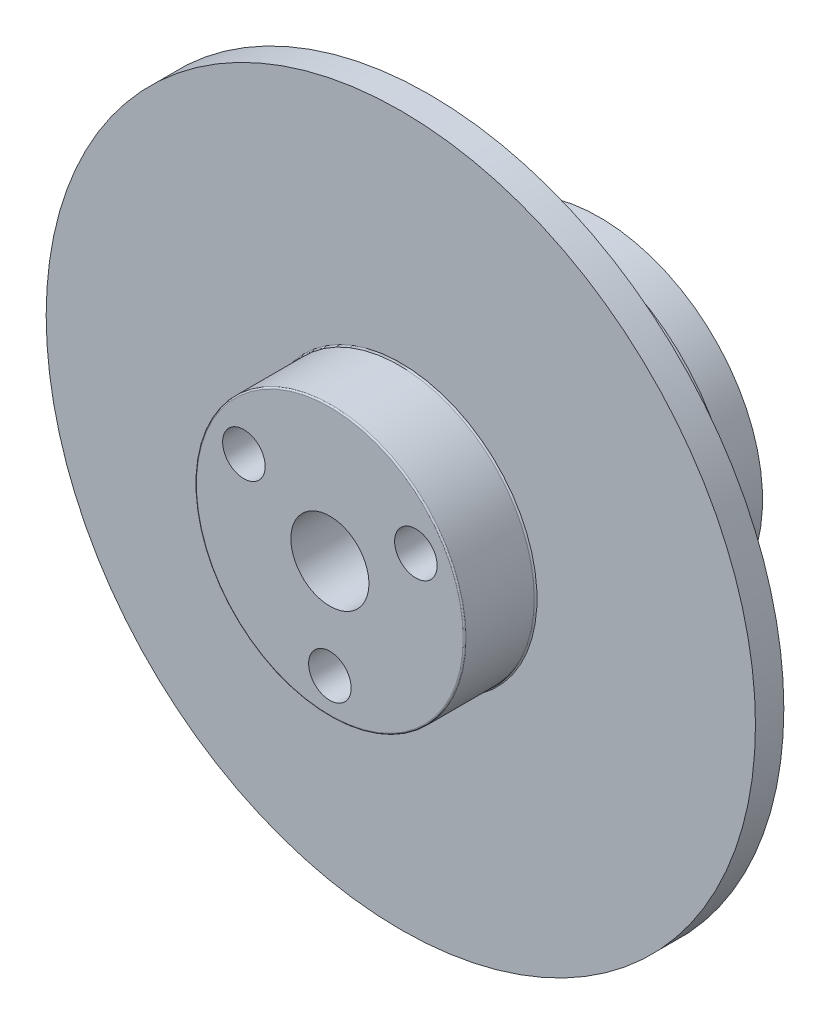
ISO-10303-21;
HEADER;
FILE_DESCRIPTION(('STEP AP214'),'2;1');
FILE_NAME('part.step','',(''),(''),'','','');
FILE_SCHEMA(('AUTOMOTIVE_DESIGN { 1 0 10303 214 1 1 1 1 }'));
ENDSEC;
DATA;
#1=APPLICATION_CONTEXT('core data for automotive mechanical design processes');
#2=APPLICATION_PROTOCOL_DEFINITION('international standard','automotive_design',2000,#1);
#3=PRODUCT_CONTEXT('',#1,'mechanical');
#4=PRODUCT('Part','Part','',(#3));
#5=PRODUCT_RELATED_PRODUCT_CATEGORY('part','',(#4));
#6=PRODUCT_DEFINITION_FORMATION('','',#4);
#7=PRODUCT_DEFINITION_CONTEXT('part definition',#1,'design');
#8=PRODUCT_DEFINITION('design','',#6,#7);
#9=PRODUCT_DEFINITION_SHAPE('','',#8);
#10=(LENGTH_UNIT() NAMED_UNIT(*) SI_UNIT(.MILLI.,.METRE.));
#11=(NAMED_UNIT(*) PLANE_ANGLE_UNIT() SI_UNIT($,.RADIAN.));
#12=(NAMED_UNIT(*) SI_UNIT($,.STERADIAN.) SOLID_ANGLE_UNIT());
#13=UNCERTAINTY_MEASURE_WITH_UNIT(LENGTH_MEASURE(1.E-05),#10,'distance_accuracy_value','');
#14=(GEOMETRIC_REPRESENTATION_CONTEXT(3) GLOBAL_UNCERTAINTY_ASSIGNED_CONTEXT((#13)) GLOBAL_UNIT_ASSIGNED_CONTEXT((#10,
#11,#12)) REPRESENTATION_CONTEXT('',''));
#15=CARTESIAN_POINT('',(0.,0.,0.));
#16=DIRECTION('',(0.,0.,1.));
#17=DIRECTION('',(1.,0.,0.));
#18=AXIS2_PLACEMENT_3D('',#15,#16,#17);
#19=CARTESIAN_POINT('',(0.,0.,5.));
#20=DIRECTION('',(0.,0.,1.));
#21=DIRECTION('',(1.,0.,0.));
#22=AXIS2_PLACEMENT_3D('',#19,#20,#21);
#23=PLANE('',#22);
#24=CARTESIAN_POINT('',(0.,0.,5.));
#25=DIRECTION('',(0.,0.,-1.));
#26=DIRECTION('',(-1.,0.,0.));
#27=AXIS2_PLACEMENT_3D('',#24,#25,#26);
#28=CIRCLE('',#27,2.75);
#29=CARTESIAN_POINT('',(-2.75,0.,5.));
#30=VERTEX_POINT('',#29);
#31=EDGE_CURVE('E114',#30,#30,#28,.T.);
#32=ORIENTED_EDGE('',*,*,#31,.T.);
#33=EDGE_LOOP('',(#32));
#34=FACE_BOUND('',#33,.T.);
#35=CARTESIAN_POINT('',(-6.0621778264911,3.49999999999994,5.));
#36=DIRECTION('',(0.,0.,1.));
#37=DIRECTION('',(1.,0.,0.));
#38=AXIS2_PLACEMENT_3D('',#35,#36,#37);
#39=CIRCLE('',#38,1.49999999999999);
#40=CARTESIAN_POINT('',(-4.56217782649111,3.49999999999994,5.));
#41=VERTEX_POINT('',#40);
#42=EDGE_CURVE('E117',#41,#41,#39,.T.);
#43=ORIENTED_EDGE('',*,*,#42,.F.);
#44=EDGE_LOOP('',(#43));
#45=FACE_BOUND('',#44,.T.);
#46=CARTESIAN_POINT('',(6.06217782649105,3.50000000000003,5.));
#47=DIRECTION('',(0.,0.,1.));
#48=DIRECTION('',(1.,0.,0.));
#49=AXIS2_PLACEMENT_3D('',#46,#47,#48);
#50=CIRCLE('',#49,1.49999999999999);
#51=CARTESIAN_POINT('',(7.56217782649104,3.50000000000003,5.));
#52=VERTEX_POINT('',#51);
#53=EDGE_CURVE('E123',#52,#52,#50,.T.);
#54=ORIENTED_EDGE('',*,*,#53,.F.);
#55=EDGE_LOOP('',(#54));
#56=FACE_BOUND('',#55,.T.);
#57=CARTESIAN_POINT('',(0.,-7.,5.));
#58=DIRECTION('',(0.,0.,1.));
#59=DIRECTION('',(1.,0.,0.));
#60=AXIS2_PLACEMENT_3D('',#57,#58,#59);
#61=CIRCLE('',#60,1.49999999999999);
#62=CARTESIAN_POINT('',(1.49999999999999,-7.,5.));
#63=VERTEX_POINT('',#62);
#64=EDGE_CURVE('E129',#63,#63,#61,.T.);
#65=ORIENTED_EDGE('',*,*,#64,.F.);
#66=EDGE_LOOP('',(#65));
#67=FACE_BOUND('',#66,.T.);
#68=CARTESIAN_POINT('',(0.,0.,5.));
#69=DIRECTION('',(0.,0.,1.));
#70=DIRECTION('',(1.,0.,0.));
#71=AXIS2_PLACEMENT_3D('',#68,#69,#70);
#72=CIRCLE('',#71,9.4);
#73=CARTESIAN_POINT('',(9.4,0.,5.));
#74=VERTEX_POINT('',#73);
#75=EDGE_CURVE('E11',#74,#74,#72,.T.);
#76=ORIENTED_EDGE('',*,*,#75,.T.);
#77=EDGE_LOOP('',(#76));
#78=FACE_BOUND('',#77,.T.);
#79=ADVANCED_FACE('F42',(#34,#45,#56,#67,#78),#23,.T.);
#80=CARTESIAN_POINT('',(0.,0.,-2.));
#81=DIRECTION('',(0.,0.,-1.));
#82=DIRECTION('',(-1.,0.,0.));
#83=AXIS2_PLACEMENT_3D('',#80,#81,#82);
#84=PLANE('',#83);
#85=CARTESIAN_POINT('',(0.,0.,-2.));
#86=DIRECTION('',(0.,0.,-1.));
#87=DIRECTION('',(-1.,0.,0.));
#88=AXIS2_PLACEMENT_3D('',#85,#86,#87);
#89=CIRCLE('',#88,13.5);
#90=CARTESIAN_POINT('',(-13.5,0.,-2.));
#91=VERTEX_POINT('',#90);
#92=EDGE_CURVE('E164',#91,#91,#89,.T.);
#93=ORIENTED_EDGE('',*,*,#92,.F.);
#94=EDGE_LOOP('',(#93));
#95=FACE_BOUND('',#94,.T.);
#96=CARTESIAN_POINT('',(0.,0.,-2.));
#97=DIRECTION('',(0.,0.,-1.));
#98=DIRECTION('',(-1.,0.,0.));
#99=AXIS2_PLACEMENT_3D('',#96,#97,#98);
#100=CIRCLE('',#99,25.);
#101=CARTESIAN_POINT('',(-25.,0.,-2.));
#102=VERTEX_POINT('',#101);
#103=EDGE_CURVE('E167',#102,#102,#100,.T.);
#104=ORIENTED_EDGE('',*,*,#103,.T.);
#105=EDGE_LOOP('',(#104));
#106=FACE_BOUND('',#105,.T.);
#107=ADVANCED_FACE('F206',(#95,#106),#84,.T.);
#108=CARTESIAN_POINT('',(0.,0.,0.));
#109=DIRECTION('',(0.,0.,-1.));
#110=DIRECTION('',(-1.,0.,0.));
#111=AXIS2_PLACEMENT_3D('',#108,#109,#110);
#112=PLANE('',#111);
#113=CARTESIAN_POINT('',(0.,0.,0.));
#114=DIRECTION('',(0.,0.,-1.));
#115=DIRECTION('',(-1.,0.,0.));
#116=AXIS2_PLACEMENT_3D('',#113,#114,#115);
#117=CIRCLE('',#116,9.6);
#118=CARTESIAN_POINT('',(-9.6,0.,0.));
#119=VERTEX_POINT('',#118);
#120=EDGE_CURVE('E50',#119,#119,#117,.T.);
#121=ORIENTED_EDGE('',*,*,#120,.T.);
#122=EDGE_LOOP('',(#121));
#123=FACE_BOUND('',#122,.T.);
#124=CARTESIAN_POINT('',(0.,0.,0.));
#125=DIRECTION('',(0.,0.,-1.));
#126=DIRECTION('',(-1.,0.,0.));
#127=AXIS2_PLACEMENT_3D('',#124,#125,#126);
#128=CIRCLE('',#127,25.);
#129=CARTESIAN_POINT('',(-25.,0.,0.));
#130=VERTEX_POINT('',#129);
#131=EDGE_CURVE('E171',#130,#130,#128,.T.);
#132=ORIENTED_EDGE('',*,*,#131,.F.);
#133=EDGE_LOOP('',(#132));
#134=FACE_BOUND('',#133,.T.);
#135=ADVANCED_FACE('F185',(#123,#134),#112,.F.);
#136=CARTESIAN_POINT('',(0.,0.,-2.));
#137=DIRECTION('',(0.,0.,1.));
#138=DIRECTION('',(1.,0.,0.));
#139=AXIS2_PLACEMENT_3D('',#136,#137,#138);
#140=CYLINDRICAL_SURFACE('',#139,25.);
#141=ORIENTED_EDGE('',*,*,#103,.F.);
#142=EDGE_LOOP('',(#141));
#143=FACE_BOUND('',#142,.T.);
#144=ORIENTED_EDGE('',*,*,#131,.T.);
#145=EDGE_LOOP('',(#144));
#146=FACE_BOUND('',#145,.T.);
#147=ADVANCED_FACE('F260',(#143,#146),#140,.T.);
#148=CARTESIAN_POINT('',(0.,0.,-4.));
#149=DIRECTION('',(0.,0.,1.));
#150=DIRECTION('',(1.,0.,0.));
#151=AXIS2_PLACEMENT_3D('',#148,#149,#150);
#152=CYLINDRICAL_SURFACE('',#151,13.5);
#153=CARTESIAN_POINT('',(0.,0.,-4.));
#154=DIRECTION('',(0.,0.,-1.));
#155=DIRECTION('',(-1.,0.,0.));
#156=AXIS2_PLACEMENT_3D('',#153,#154,#155);
#157=CIRCLE('',#156,13.5);
#158=CARTESIAN_POINT('',(-13.5,0.,-4.));
#159=VERTEX_POINT('',#158);
#160=EDGE_CURVE('E168',#159,#159,#157,.T.);
#161=ORIENTED_EDGE('',*,*,#160,.F.);
#162=EDGE_LOOP('',(#161));
#163=FACE_BOUND('',#162,.T.);
#164=ORIENTED_EDGE('',*,*,#92,.T.);
#165=EDGE_LOOP('',(#164));
#166=FACE_BOUND('',#165,.T.);
#167=ADVANCED_FACE('F257',(#163,#166),#152,.T.);
#168=CARTESIAN_POINT('',(0.,0.,-4.));
#169=DIRECTION('',(0.,0.,-1.));
#170=DIRECTION('',(-1.,0.,0.));
#171=AXIS2_PLACEMENT_3D('',#168,#169,#170);
#172=PLANE('',#171);
#173=CARTESIAN_POINT('',(0.,0.,-4.));
#174=DIRECTION('',(0.,0.,-1.));
#175=DIRECTION('',(-1.,0.,0.));
#176=AXIS2_PLACEMENT_3D('',#173,#174,#175);
#177=CIRCLE('',#176,12.5);
#178=CARTESIAN_POINT('',(-12.5,0.,-4.));
#179=VERTEX_POINT('',#178);
#180=EDGE_CURVE('E152',#179,#179,#177,.T.);
#181=ORIENTED_EDGE('',*,*,#180,.F.);
#182=EDGE_LOOP('',(#181));
#183=FACE_BOUND('',#182,.T.);
#184=ORIENTED_EDGE('',*,*,#160,.T.);
#185=EDGE_LOOP('',(#184));
#186=FACE_BOUND('',#185,.T.);
#187=ADVANCED_FACE('F253',(#183,#186),#172,.T.);
#188=CARTESIAN_POINT('',(0.,0.,-11.));
#189=DIRECTION('',(0.,0.,1.));
#190=DIRECTION('',(1.,0.,0.));
#191=AXIS2_PLACEMENT_3D('',#188,#189,#190);
#192=CYLINDRICAL_SURFACE('',#191,12.5);
#193=CARTESIAN_POINT('',(0.,0.,-11.));
#194=DIRECTION('',(0.,0.,-1.));
#195=DIRECTION('',(-1.,0.,0.));
#196=AXIS2_PLACEMENT_3D('',#193,#194,#195);
#197=CIRCLE('',#196,12.5);
#198=CARTESIAN_POINT('',(-12.5,0.,-11.));
#199=VERTEX_POINT('',#198);
#200=EDGE_CURVE('E161',#199,#199,#197,.T.);
#201=ORIENTED_EDGE('',*,*,#200,.F.);
#202=EDGE_LOOP('',(#201));
#203=FACE_BOUND('',#202,.T.);
#204=ORIENTED_EDGE('',*,*,#180,.T.);
#205=EDGE_LOOP('',(#204));
#206=FACE_BOUND('',#205,.T.);
#207=ADVANCED_FACE('F249',(#203,#206),#192,.T.);
#208=CARTESIAN_POINT('',(0.,0.,-11.));
#209=DIRECTION('',(0.,0.,-1.));
#210=DIRECTION('',(-1.,0.,0.));
#211=AXIS2_PLACEMENT_3D('',#208,#209,#210);
#212=PLANE('',#211);
#213=CARTESIAN_POINT('',(0.,0.,-11.));
#214=DIRECTION('',(0.,0.,-1.));
#215=DIRECTION('',(-1.,0.,0.));
#216=AXIS2_PLACEMENT_3D('',#213,#214,#215);
#217=CIRCLE('',#216,11.5);
#218=CARTESIAN_POINT('',(-11.5,0.,-11.));
#219=VERTEX_POINT('',#218);
#220=EDGE_CURVE('E148',#219,#219,#217,.T.);
#221=ORIENTED_EDGE('',*,*,#220,.F.);
#222=EDGE_LOOP('',(#221));
#223=FACE_BOUND('',#222,.T.);
#224=ORIENTED_EDGE('',*,*,#200,.T.);
#225=EDGE_LOOP('',(#224));
#226=FACE_BOUND('',#225,.T.);
#227=ADVANCED_FACE('F225',(#223,#226),#212,.T.);
#228=CARTESIAN_POINT('',(0.,0.,-14.));
#229=DIRECTION('',(0.,0.,1.));
#230=DIRECTION('',(1.,0.,0.));
#231=AXIS2_PLACEMENT_3D('',#228,#229,#230);
#232=CYLINDRICAL_SURFACE('',#231,11.5);
#233=CARTESIAN_POINT('',(0.,0.,-14.));
#234=DIRECTION('',(0.,0.,-1.));
#235=DIRECTION('',(-1.,0.,0.));
#236=AXIS2_PLACEMENT_3D('',#233,#234,#235);
#237=CIRCLE('',#236,11.5);
#238=CARTESIAN_POINT('',(-11.5,0.,-14.));
#239=VERTEX_POINT('',#238);
#240=EDGE_CURVE('E144',#239,#239,#237,.T.);
#241=ORIENTED_EDGE('',*,*,#240,.F.);
#242=EDGE_LOOP('',(#241));
#243=FACE_BOUND('',#242,.T.);
#244=ORIENTED_EDGE('',*,*,#220,.T.);
#245=EDGE_LOOP('',(#244));
#246=FACE_BOUND('',#245,.T.);
#247=ADVANCED_FACE('F221',(#243,#246),#232,.T.);
#248=CARTESIAN_POINT('',(0.,0.,-14.));
#249=DIRECTION('',(0.,0.,-1.));
#250=DIRECTION('',(-1.,0.,0.));
#251=AXIS2_PLACEMENT_3D('',#248,#249,#250);
#252=PLANE('',#251);
#253=CARTESIAN_POINT('',(7.36121593216775,-4.24999999999996,-14.));
#254=DIRECTION('',(0.,0.,-1.));
#255=DIRECTION('',(-1.,0.,0.));
#256=AXIS2_PLACEMENT_3D('',#253,#254,#255);
#257=CIRCLE('',#256,1.49999999999999);
#258=CARTESIAN_POINT('',(5.86121593216776,-4.24999999999996,-14.));
#259=VERTEX_POINT('',#258);
#260=EDGE_CURVE('E89',#259,#259,#257,.T.);
#261=ORIENTED_EDGE('',*,*,#260,.F.);
#262=EDGE_LOOP('',(#261));
#263=FACE_BOUND('',#262,.T.);
#264=CARTESIAN_POINT('',(-7.36121593216773,-4.25000000000001,-14.));
#265=DIRECTION('',(0.,0.,-1.));
#266=DIRECTION('',(-1.,0.,0.));
#267=AXIS2_PLACEMENT_3D('',#264,#265,#266);
#268=CIRCLE('',#267,1.49999999999999);
#269=CARTESIAN_POINT('',(-8.86121593216772,-4.25000000000001,-14.));
#270=VERTEX_POINT('',#269);
#271=EDGE_CURVE('E88',#270,#270,#268,.T.);
#272=ORIENTED_EDGE('',*,*,#271,.F.);
#273=EDGE_LOOP('',(#272));
#274=FACE_BOUND('',#273,.T.);
#275=CARTESIAN_POINT('',(0.,8.5,-14.));
#276=DIRECTION('',(0.,0.,-1.));
#277=DIRECTION('',(-1.,0.,0.));
#278=AXIS2_PLACEMENT_3D('',#275,#276,#277);
#279=CIRCLE('',#278,1.49999999999999);
#280=CARTESIAN_POINT('',(-1.49999999999996,8.5,-14.));
#281=VERTEX_POINT('',#280);
#282=EDGE_CURVE('E99',#281,#281,#279,.T.);
#283=ORIENTED_EDGE('',*,*,#282,.F.);
#284=EDGE_LOOP('',(#283));
#285=FACE_BOUND('',#284,.T.);
#286=CARTESIAN_POINT('',(0.,0.,-14.));
#287=DIRECTION('',(0.,0.,-1.));
#288=DIRECTION('',(-1.,0.,0.));
#289=AXIS2_PLACEMENT_3D('',#286,#287,#288);
#290=CIRCLE('',#289,5.);
#291=CARTESIAN_POINT('',(-5.,0.,-14.));
#292=VERTEX_POINT('',#291);
#293=EDGE_CURVE('E105',#292,#292,#290,.T.);
#294=ORIENTED_EDGE('',*,*,#293,.F.);
#295=EDGE_LOOP('',(#294));
#296=FACE_BOUND('',#295,.T.);
#297=CARTESIAN_POINT('',(-6.0621778264911,3.49999999999994,-14.));
#298=DIRECTION('',(0.,0.,-1.));
#299=DIRECTION('',(-1.,0.,0.));
#300=AXIS2_PLACEMENT_3D('',#297,#298,#299);
#301=CIRCLE('',#300,1.25);
#302=CARTESIAN_POINT('',(-7.3121778264911,3.49999999999994,-14.));
#303=VERTEX_POINT('',#302);
#304=EDGE_CURVE('E135',#303,#303,#301,.F.);
#305=ORIENTED_EDGE('',*,*,#304,.T.);
#306=EDGE_LOOP('',(#305));
#307=FACE_BOUND('',#306,.T.);
#308=CARTESIAN_POINT('',(0.,-7.,-14.));
#309=DIRECTION('',(0.,0.,-1.));
#310=DIRECTION('',(-1.,0.,0.));
#311=AXIS2_PLACEMENT_3D('',#308,#309,#310);
#312=CIRCLE('',#311,1.25);
#313=CARTESIAN_POINT('',(-1.25,-7.,-14.));
#314=VERTEX_POINT('',#313);
#315=EDGE_CURVE('E138',#314,#314,#312,.F.);
#316=ORIENTED_EDGE('',*,*,#315,.T.);
#317=EDGE_LOOP('',(#316));
#318=FACE_BOUND('',#317,.T.);
#319=CARTESIAN_POINT('',(6.06217782649106,3.50000000000003,-14.));
#320=DIRECTION('',(0.,0.,-1.));
#321=DIRECTION('',(-1.,0.,0.));
#322=AXIS2_PLACEMENT_3D('',#319,#320,#321);
#323=CIRCLE('',#322,1.25);
#324=CARTESIAN_POINT('',(4.81217782649106,3.50000000000003,-14.));
#325=VERTEX_POINT('',#324);
#326=EDGE_CURVE('E141',#325,#325,#323,.F.);
#327=ORIENTED_EDGE('',*,*,#326,.T.);
#328=EDGE_LOOP('',(#327));
#329=FACE_BOUND('',#328,.T.);
#330=ORIENTED_EDGE('',*,*,#240,.T.);
#331=EDGE_LOOP('',(#330));
#332=FACE_BOUND('',#331,.T.);
#333=ADVANCED_FACE('F217',(#263,#274,#285,#296,#307,#318,#329,#332),#252,.T.);
#334=CARTESIAN_POINT('',(0.,-7.,-6.));
#335=DIRECTION('',(0.,0.,-1.));
#336=DIRECTION('',(-1.,0.,0.));
#337=AXIS2_PLACEMENT_3D('',#334,#335,#336);
#338=CONICAL_SURFACE('',#337,1.25,1.02974425867665);
#339=CARTESIAN_POINT('',(0.,-7.,-5.24892422621555));
#340=VERTEX_POINT('',#339);
#341=VERTEX_LOOP('',#340);
#342=FACE_BOUND('',#341,.T.);
#343=CARTESIAN_POINT('',(0.,-7.,-6.));
#344=DIRECTION('',(0.,0.,-1.));
#345=DIRECTION('',(-1.,0.,0.));
#346=AXIS2_PLACEMENT_3D('',#343,#344,#345);
#347=CIRCLE('',#346,1.25);
#348=CARTESIAN_POINT('',(-1.25,-7.,-6.));
#349=VERTEX_POINT('',#348);
#350=EDGE_CURVE('E158',#349,#349,#347,.T.);
#351=ORIENTED_EDGE('',*,*,#350,.T.);
#352=EDGE_LOOP('',(#351));
#353=FACE_BOUND('',#352,.T.);
#354=ADVANCED_FACE('F220',(#342,#353),#338,.F.);
#355=CARTESIAN_POINT('',(0.,-7.,-11.));
#356=DIRECTION('',(0.,0.,-1.));
#357=DIRECTION('',(-1.,0.,0.));
#358=AXIS2_PLACEMENT_3D('',#355,#356,#357);
#359=CYLINDRICAL_SURFACE('',#358,1.25);
#360=ORIENTED_EDGE('',*,*,#350,.F.);
#361=EDGE_LOOP('',(#360));
#362=FACE_BOUND('',#361,.T.);
#363=ORIENTED_EDGE('',*,*,#315,.F.);
#364=EDGE_LOOP('',(#363));
#365=FACE_BOUND('',#364,.T.);
#366=ADVANCED_FACE('F241',(#362,#365),#359,.F.);
#367=CARTESIAN_POINT('',(6.06217782649106,3.50000000000003,-6.));
#368=DIRECTION('',(0.,0.,-1.));
#369=DIRECTION('',(-1.,0.,0.));
#370=AXIS2_PLACEMENT_3D('',#367,#368,#369);
#371=CONICAL_SURFACE('',#370,1.25,1.02974425867665);
#372=CARTESIAN_POINT('',(6.06217782649105,3.50000000000003,-5.24892422621555));
#373=VERTEX_POINT('',#372);
#374=VERTEX_LOOP('',#373);
#375=FACE_BOUND('',#374,.T.);
#376=CARTESIAN_POINT('',(6.06217782649106,3.50000000000003,-6.));
#377=DIRECTION('',(0.,0.,-1.));
#378=DIRECTION('',(-1.,0.,0.));
#379=AXIS2_PLACEMENT_3D('',#376,#377,#378);
#380=CIRCLE('',#379,1.25);
#381=CARTESIAN_POINT('',(4.81217782649106,3.50000000000003,-6.));
#382=VERTEX_POINT('',#381);
#383=EDGE_CURVE('E155',#382,#382,#380,.T.);
#384=ORIENTED_EDGE('',*,*,#383,.T.);
#385=EDGE_LOOP('',(#384));
#386=FACE_BOUND('',#385,.T.);
#387=ADVANCED_FACE('F237',(#375,#386),#371,.F.);
#388=CARTESIAN_POINT('',(6.06217782649106,3.50000000000003,-11.));
#389=DIRECTION('',(0.,0.,-1.));
#390=DIRECTION('',(-1.,0.,0.));
#391=AXIS2_PLACEMENT_3D('',#388,#389,#390);
#392=CYLINDRICAL_SURFACE('',#391,1.25);
#393=ORIENTED_EDGE('',*,*,#383,.F.);
#394=EDGE_LOOP('',(#393));
#395=FACE_BOUND('',#394,.T.);
#396=ORIENTED_EDGE('',*,*,#326,.F.);
#397=EDGE_LOOP('',(#396));
#398=FACE_BOUND('',#397,.T.);
#399=ADVANCED_FACE('F233',(#395,#398),#392,.F.);
#400=CARTESIAN_POINT('',(-6.0621778264911,3.49999999999994,-6.));
#401=DIRECTION('',(0.,0.,-1.));
#402=DIRECTION('',(-1.,0.,0.));
#403=AXIS2_PLACEMENT_3D('',#400,#401,#402);
#404=CONICAL_SURFACE('',#403,1.25,1.02974425867665);
#405=CARTESIAN_POINT('',(-6.06217782649111,3.49999999999994,-5.24892422621555));
#406=VERTEX_POINT('',#405);
#407=VERTEX_LOOP('',#406);
#408=FACE_BOUND('',#407,.T.);
#409=CARTESIAN_POINT('',(-6.0621778264911,3.49999999999994,-6.));
#410=DIRECTION('',(0.,0.,-1.));
#411=DIRECTION('',(-1.,0.,0.));
#412=AXIS2_PLACEMENT_3D('',#409,#410,#411);
#413=CIRCLE('',#412,1.25);
#414=CARTESIAN_POINT('',(-7.3121778264911,3.49999999999994,-6.));
#415=VERTEX_POINT('',#414);
#416=EDGE_CURVE('E147',#415,#415,#413,.T.);
#417=ORIENTED_EDGE('',*,*,#416,.T.);
#418=EDGE_LOOP('',(#417));
#419=FACE_BOUND('',#418,.T.);
#420=ADVANCED_FACE('F229',(#408,#419),#404,.F.);
#421=CARTESIAN_POINT('',(-6.0621778264911,3.49999999999994,-11.));
#422=DIRECTION('',(0.,0.,-1.));
#423=DIRECTION('',(-1.,0.,0.));
#424=AXIS2_PLACEMENT_3D('',#421,#422,#423);
#425=CYLINDRICAL_SURFACE('',#424,1.25);
#426=ORIENTED_EDGE('',*,*,#416,.F.);
#427=EDGE_LOOP('',(#426));
#428=FACE_BOUND('',#427,.T.);
#429=ORIENTED_EDGE('',*,*,#304,.F.);
#430=EDGE_LOOP('',(#429));
#431=FACE_BOUND('',#430,.T.);
#432=ADVANCED_FACE('F196',(#428,#431),#425,.F.);
#433=CARTESIAN_POINT('',(0.,0.,0.));
#434=DIRECTION('',(0.,0.,1.));
#435=DIRECTION('',(1.,0.,0.));
#436=AXIS2_PLACEMENT_3D('',#433,#434,#435);
#437=CYLINDRICAL_SURFACE('',#436,9.5);
#438=CARTESIAN_POINT('',(0.,0.,0.0999999999999996));
#439=DIRECTION('',(0.,0.,-1.));
#440=DIRECTION('',(-1.,0.,0.));
#441=AXIS2_PLACEMENT_3D('',#438,#439,#440);
#442=CIRCLE('',#441,9.5);
#443=CARTESIAN_POINT('',(-9.5,0.,0.0999999999999996));
#444=VERTEX_POINT('',#443);
#445=EDGE_CURVE('E180',#444,#444,#442,.F.);
#446=ORIENTED_EDGE('',*,*,#445,.T.);
#447=EDGE_LOOP('',(#446));
#448=FACE_BOUND('',#447,.T.);
#449=CARTESIAN_POINT('',(0.,0.,4.9));
#450=DIRECTION('',(0.,0.,1.));
#451=DIRECTION('',(1.,0.,0.));
#452=AXIS2_PLACEMENT_3D('',#449,#450,#451);
#453=CIRCLE('',#452,9.5);
#454=CARTESIAN_POINT('',(9.5,0.,4.9));
#455=VERTEX_POINT('',#454);
#456=EDGE_CURVE('E151',#455,#455,#453,.F.);
#457=ORIENTED_EDGE('',*,*,#456,.T.);
#458=EDGE_LOOP('',(#457));
#459=FACE_BOUND('',#458,.T.);
#460=ADVANCED_FACE('F191',(#448,#459),#437,.T.);
#461=CARTESIAN_POINT('',(0.,0.,0.0999999999999996));
#462=DIRECTION('',(0.,0.,-1.));
#463=DIRECTION('',(-1.,0.,0.));
#464=AXIS2_PLACEMENT_3D('',#461,#462,#463);
#465=TOROIDAL_SURFACE('',#464,9.6,0.1);
#466=ORIENTED_EDGE('',*,*,#120,.F.);
#467=EDGE_LOOP('',(#466));
#468=FACE_BOUND('',#467,.T.);
#469=ORIENTED_EDGE('',*,*,#445,.F.);
#470=EDGE_LOOP('',(#469));
#471=FACE_BOUND('',#470,.T.);
#472=ADVANCED_FACE('F188',(#468,#471),#465,.F.);
#473=CARTESIAN_POINT('',(0.,0.,4.9));
#474=DIRECTION('',(0.,0.,1.));
#475=DIRECTION('',(1.,0.,0.));
#476=AXIS2_PLACEMENT_3D('',#473,#474,#475);
#477=TOROIDAL_SURFACE('',#476,9.4,0.1);
#478=ORIENTED_EDGE('',*,*,#456,.F.);
#479=EDGE_LOOP('',(#478));
#480=FACE_BOUND('',#479,.T.);
#481=ORIENTED_EDGE('',*,*,#75,.F.);
#482=EDGE_LOOP('',(#481));
#483=FACE_BOUND('',#482,.T.);
#484=ADVANCED_FACE('F44',(#480,#483),#477,.T.);
#485=CARTESIAN_POINT('',(0.,-7.,0.));
#486=DIRECTION('',(0.,0.,1.));
#487=DIRECTION('',(1.,0.,0.));
#488=AXIS2_PLACEMENT_3D('',#485,#486,#487);
#489=CONICAL_SURFACE('',#488,1.5,1.02974425867665);
#490=CARTESIAN_POINT('',(0.,-7.,-0.901290928541342));
#491=VERTEX_POINT('',#490);
#492=VERTEX_LOOP('',#491);
#493=FACE_BOUND('',#492,.T.);
#494=CARTESIAN_POINT('',(0.,-7.,0.));
#495=DIRECTION('',(0.,0.,1.));
#496=DIRECTION('',(1.,0.,0.));
#497=AXIS2_PLACEMENT_3D('',#494,#495,#496);
#498=CIRCLE('',#497,1.5);
#499=CARTESIAN_POINT('',(1.5,-7.,0.));
#500=VERTEX_POINT('',#499);
#501=EDGE_CURVE('E132',#500,#500,#498,.T.);
#502=ORIENTED_EDGE('',*,*,#501,.T.);
#503=EDGE_LOOP('',(#502));
#504=FACE_BOUND('',#503,.T.);
#505=ADVANCED_FACE('F202',(#493,#504),#489,.F.);
#506=CARTESIAN_POINT('',(0.,-7.,5.));
#507=DIRECTION('',(0.,0.,1.));
#508=DIRECTION('',(1.,0.,0.));
#509=AXIS2_PLACEMENT_3D('',#506,#507,#508);
#510=CYLINDRICAL_SURFACE('',#509,1.49999999999999);
#511=ORIENTED_EDGE('',*,*,#501,.F.);
#512=EDGE_LOOP('',(#511));
#513=FACE_BOUND('',#512,.T.);
#514=ORIENTED_EDGE('',*,*,#64,.T.);
#515=EDGE_LOOP('',(#514));
#516=FACE_BOUND('',#515,.T.);
#517=ADVANCED_FACE('F344',(#513,#516),#510,.F.);
#518=CARTESIAN_POINT('',(6.06217782649105,3.50000000000003,0.));
#519=DIRECTION('',(0.,0.,1.));
#520=DIRECTION('',(1.,0.,0.));
#521=AXIS2_PLACEMENT_3D('',#518,#519,#520);
#522=CONICAL_SURFACE('',#521,1.5,1.02974425867665);
#523=CARTESIAN_POINT('',(6.06217782649105,3.50000000000003,-0.901290928541342));
#524=VERTEX_POINT('',#523);
#525=VERTEX_LOOP('',#524);
#526=FACE_BOUND('',#525,.T.);
#527=CARTESIAN_POINT('',(6.06217782649105,3.50000000000003,0.));
#528=DIRECTION('',(0.,0.,1.));
#529=DIRECTION('',(1.,0.,0.));
#530=AXIS2_PLACEMENT_3D('',#527,#528,#529);
#531=CIRCLE('',#530,1.5);
#532=CARTESIAN_POINT('',(7.56217782649105,3.50000000000003,0.));
#533=VERTEX_POINT('',#532);
#534=EDGE_CURVE('E126',#533,#533,#531,.T.);
#535=ORIENTED_EDGE('',*,*,#534,.T.);
#536=EDGE_LOOP('',(#535));
#537=FACE_BOUND('',#536,.T.);
#538=ADVANCED_FACE('F351',(#526,#537),#522,.F.);
#539=CARTESIAN_POINT('',(6.06217782649105,3.50000000000003,5.));
#540=DIRECTION('',(0.,0.,1.));
#541=DIRECTION('',(1.,0.,0.));
#542=AXIS2_PLACEMENT_3D('',#539,#540,#541);
#543=CYLINDRICAL_SURFACE('',#542,1.49999999999999);
#544=ORIENTED_EDGE('',*,*,#534,.F.);
#545=EDGE_LOOP('',(#544));
#546=FACE_BOUND('',#545,.T.);
#547=ORIENTED_EDGE('',*,*,#53,.T.);
#548=EDGE_LOOP('',(#547));
#549=FACE_BOUND('',#548,.T.);
#550=ADVANCED_FACE('F359',(#546,#549),#543,.F.);
#551=CARTESIAN_POINT('',(-6.0621778264911,3.49999999999994,0.));
#552=DIRECTION('',(0.,0.,1.));
#553=DIRECTION('',(1.,0.,0.));
#554=AXIS2_PLACEMENT_3D('',#551,#552,#553);
#555=CONICAL_SURFACE('',#554,1.5,1.02974425867665);
#556=CARTESIAN_POINT('',(-6.0621778264911,3.49999999999994,-0.901290928541342));
#557=VERTEX_POINT('',#556);
#558=VERTEX_LOOP('',#557);
#559=FACE_BOUND('',#558,.T.);
#560=CARTESIAN_POINT('',(-6.0621778264911,3.49999999999994,0.));
#561=DIRECTION('',(0.,0.,1.));
#562=DIRECTION('',(1.,0.,0.));
#563=AXIS2_PLACEMENT_3D('',#560,#561,#562);
#564=CIRCLE('',#563,1.5);
#565=CARTESIAN_POINT('',(-4.56217782649111,3.49999999999994,0.));
#566=VERTEX_POINT('',#565);
#567=EDGE_CURVE('E120',#566,#566,#564,.T.);
#568=ORIENTED_EDGE('',*,*,#567,.T.);
#569=EDGE_LOOP('',(#568));
#570=FACE_BOUND('',#569,.T.);
#571=ADVANCED_FACE('F367',(#559,#570),#555,.F.);
#572=CARTESIAN_POINT('',(-6.0621778264911,3.49999999999994,5.));
#573=DIRECTION('',(0.,0.,1.));
#574=DIRECTION('',(1.,0.,0.));
#575=AXIS2_PLACEMENT_3D('',#572,#573,#574);
#576=CYLINDRICAL_SURFACE('',#575,1.49999999999999);
#577=ORIENTED_EDGE('',*,*,#567,.F.);
#578=EDGE_LOOP('',(#577));
#579=FACE_BOUND('',#578,.T.);
#580=ORIENTED_EDGE('',*,*,#42,.T.);
#581=EDGE_LOOP('',(#580));
#582=FACE_BOUND('',#581,.T.);
#583=ADVANCED_FACE('F375',(#579,#582),#576,.F.);
#584=CARTESIAN_POINT('',(0.,0.,-14.));
#585=DIRECTION('',(0.,0.,-1.));
#586=DIRECTION('',(-1.,0.,0.));
#587=AXIS2_PLACEMENT_3D('',#584,#585,#586);
#588=CYLINDRICAL_SURFACE('',#587,2.75);
#589=ORIENTED_EDGE('',*,*,#31,.F.);
#590=EDGE_LOOP('',(#589));
#591=FACE_BOUND('',#590,.T.);
#592=CARTESIAN_POINT('',(0.,0.,-8.6));
#593=DIRECTION('',(0.,0.,-1.));
#594=DIRECTION('',(-1.,0.,0.));
#595=AXIS2_PLACEMENT_3D('',#592,#593,#594);
#596=CIRCLE('',#595,2.75);
#597=CARTESIAN_POINT('',(-2.75,0.,-8.6));
#598=VERTEX_POINT('',#597);
#599=EDGE_CURVE('E111',#598,#598,#596,.T.);
#600=ORIENTED_EDGE('',*,*,#599,.T.);
#601=EDGE_LOOP('',(#600));
#602=FACE_BOUND('',#601,.T.);
#603=ADVANCED_FACE('F383',(#591,#602),#588,.F.);
#604=CARTESIAN_POINT('',(2.75,0.,-8.6));
#605=DIRECTION('',(0.,0.,1.));
#606=DIRECTION('',(1.,0.,0.));
#607=AXIS2_PLACEMENT_3D('',#604,#605,#606);
#608=PLANE('',#607);
#609=ORIENTED_EDGE('',*,*,#599,.F.);
#610=EDGE_LOOP('',(#609));
#611=FACE_BOUND('',#610,.T.);
#612=CARTESIAN_POINT('',(0.,0.,-8.6));
#613=DIRECTION('',(0.,0.,-1.));
#614=DIRECTION('',(-1.,0.,0.));
#615=AXIS2_PLACEMENT_3D('',#612,#613,#614);
#616=CIRCLE('',#615,5.);
#617=CARTESIAN_POINT('',(-5.,0.,-8.6));
#618=VERTEX_POINT('',#617);
#619=EDGE_CURVE('E108',#618,#618,#616,.T.);
#620=ORIENTED_EDGE('',*,*,#619,.T.);
#621=EDGE_LOOP('',(#620));
#622=FACE_BOUND('',#621,.T.);
#623=ADVANCED_FACE('F391',(#611,#622),#608,.F.);
#624=CARTESIAN_POINT('',(0.,0.,-14.));
#625=DIRECTION('',(0.,0.,-1.));
#626=DIRECTION('',(-1.,0.,0.));
#627=AXIS2_PLACEMENT_3D('',#624,#625,#626);
#628=CYLINDRICAL_SURFACE('',#627,5.);
#629=ORIENTED_EDGE('',*,*,#619,.F.);
#630=EDGE_LOOP('',(#629));
#631=FACE_BOUND('',#630,.T.);
#632=ORIENTED_EDGE('',*,*,#293,.T.);
#633=EDGE_LOOP('',(#632));
#634=FACE_BOUND('',#633,.T.);
#635=ADVANCED_FACE('F399',(#631,#634),#628,.F.);
#636=CARTESIAN_POINT('',(0.,8.5,-8.99999999999999));
#637=DIRECTION('',(0.,0.,-1.));
#638=DIRECTION('',(-1.,0.,0.));
#639=AXIS2_PLACEMENT_3D('',#636,#637,#638);
#640=CONICAL_SURFACE('',#639,1.49999999999999,1.02974425867665);
#641=CARTESIAN_POINT('',(0.,8.5,-8.09870907145866));
#642=VERTEX_POINT('',#641);
#643=VERTEX_LOOP('',#642);
#644=FACE_BOUND('',#643,.T.);
#645=CARTESIAN_POINT('',(0.,8.5,-8.99999999999999));
#646=DIRECTION('',(0.,0.,-1.));
#647=DIRECTION('',(-1.,0.,0.));
#648=AXIS2_PLACEMENT_3D('',#645,#646,#647);
#649=CIRCLE('',#648,1.49999999999999);
#650=CARTESIAN_POINT('',(-1.49999999999996,8.5,-8.99999999999999));
#651=VERTEX_POINT('',#650);
#652=EDGE_CURVE('E102',#651,#651,#649,.T.);
#653=ORIENTED_EDGE('',*,*,#652,.T.);
#654=EDGE_LOOP('',(#653));
#655=FACE_BOUND('',#654,.T.);
#656=ADVANCED_FACE('F407',(#644,#655),#640,.F.);
#657=CARTESIAN_POINT('',(0.,8.5,-14.));
#658=DIRECTION('',(0.,0.,-1.));
#659=DIRECTION('',(-1.,0.,0.));
#660=AXIS2_PLACEMENT_3D('',#657,#658,#659);
#661=CYLINDRICAL_SURFACE('',#660,1.49999999999999);
#662=ORIENTED_EDGE('',*,*,#652,.F.);
#663=EDGE_LOOP('',(#662));
#664=FACE_BOUND('',#663,.T.);
#665=ORIENTED_EDGE('',*,*,#282,.T.);
#666=EDGE_LOOP('',(#665));
#667=FACE_BOUND('',#666,.T.);
#668=ADVANCED_FACE('F415',(#664,#667),#661,.F.);
#669=CARTESIAN_POINT('',(-7.36121593216773,-4.25000000000001,-8.99999999999999));
#670=DIRECTION('',(0.,0.,-1.));
#671=DIRECTION('',(-1.,0.,0.));
#672=AXIS2_PLACEMENT_3D('',#669,#670,#671);
#673=CONICAL_SURFACE('',#672,1.49999999999999,1.02974425867665);
#674=CARTESIAN_POINT('',(-7.36121593216773,-4.25000000000001,-8.09870907145866));
#675=VERTEX_POINT('',#674);
#676=VERTEX_LOOP('',#675);
#677=FACE_BOUND('',#676,.T.);
#678=CARTESIAN_POINT('',(-7.36121593216773,-4.25000000000001,-8.99999999999999));
#679=DIRECTION('',(0.,0.,-1.));
#680=DIRECTION('',(-1.,0.,0.));
#681=AXIS2_PLACEMENT_3D('',#678,#679,#680);
#682=CIRCLE('',#681,1.49999999999999);
#683=CARTESIAN_POINT('',(-8.86121593216771,-4.25000000000001,-8.99999999999999));
#684=VERTEX_POINT('',#683);
#685=EDGE_CURVE('E92',#684,#684,#682,.T.);
#686=ORIENTED_EDGE('',*,*,#685,.T.);
#687=EDGE_LOOP('',(#686));
#688=FACE_BOUND('',#687,.T.);
#689=ADVANCED_FACE('F422',(#677,#688),#673,.F.);
#690=CARTESIAN_POINT('',(-7.36121593216773,-4.25000000000001,-14.));
#691=DIRECTION('',(0.,0.,-1.));
#692=DIRECTION('',(-1.,0.,0.));
#693=AXIS2_PLACEMENT_3D('',#690,#691,#692);
#694=CYLINDRICAL_SURFACE('',#693,1.49999999999999);
#695=ORIENTED_EDGE('',*,*,#685,.F.);
#696=EDGE_LOOP('',(#695));
#697=FACE_BOUND('',#696,.T.);
#698=ORIENTED_EDGE('',*,*,#271,.T.);
#699=EDGE_LOOP('',(#698));
#700=FACE_BOUND('',#699,.T.);
#701=ADVANCED_FACE('F82',(#697,#700),#694,.F.);
#702=CARTESIAN_POINT('',(7.36121593216775,-4.24999999999996,-8.99999999999999));
#703=DIRECTION('',(0.,0.,-1.));
#704=DIRECTION('',(-1.,0.,0.));
#705=AXIS2_PLACEMENT_3D('',#702,#703,#704);
#706=CONICAL_SURFACE('',#705,1.49999999999999,1.02974425867665);
#707=CARTESIAN_POINT('',(7.36121593216775,-4.24999999999996,-8.09870907145866));
#708=VERTEX_POINT('',#707);
#709=VERTEX_LOOP('',#708);
#710=FACE_BOUND('',#709,.T.);
#711=CARTESIAN_POINT('',(7.36121593216775,-4.24999999999996,-8.99999999999999));
#712=DIRECTION('',(0.,0.,-1.));
#713=DIRECTION('',(-1.,0.,0.));
#714=AXIS2_PLACEMENT_3D('',#711,#712,#713);
#715=CIRCLE('',#714,1.49999999999999);
#716=CARTESIAN_POINT('',(5.86121593216776,-4.24999999999996,-8.99999999999999));
#717=VERTEX_POINT('',#716);
#718=EDGE_CURVE('E86',#717,#717,#715,.T.);
#719=ORIENTED_EDGE('',*,*,#718,.T.);
#720=EDGE_LOOP('',(#719));
#721=FACE_BOUND('',#720,.T.);
#722=ADVANCED_FACE('F78',(#710,#721),#706,.F.);
#723=CARTESIAN_POINT('',(7.36121593216775,-4.24999999999996,-14.));
#724=DIRECTION('',(0.,0.,-1.));
#725=DIRECTION('',(-1.,0.,0.));
#726=AXIS2_PLACEMENT_3D('',#723,#724,#725);
#727=CYLINDRICAL_SURFACE('',#726,1.49999999999999);
#728=ORIENTED_EDGE('',*,*,#718,.F.);
#729=EDGE_LOOP('',(#728));
#730=FACE_BOUND('',#729,.T.);
#731=ORIENTED_EDGE('',*,*,#260,.T.);
#732=EDGE_LOOP('',(#731));
#733=FACE_BOUND('',#732,.T.);
#734=ADVANCED_FACE('F81',(#730,#733),#727,.F.);
#735=CLOSED_SHELL('',(#79,#107,#135,#147,#167,#187,#207,#227,#247,#333,#354,#366,#387,#399,#420,
#432,#460,#472,#484,#505,#517,#538,#550,#571,#583,#603,#623,#635,#656,#668,#689,#701,#722,#734));
#736=MANIFOLD_SOLID_BREP('B2',#735);
#737=ADVANCED_BREP_SHAPE_REPRESENTATION('',(#18,#736),#14);
#738=SHAPE_DEFINITION_REPRESENTATION(#9,#737);
ENDSEC;
END-ISO-10303-21;
